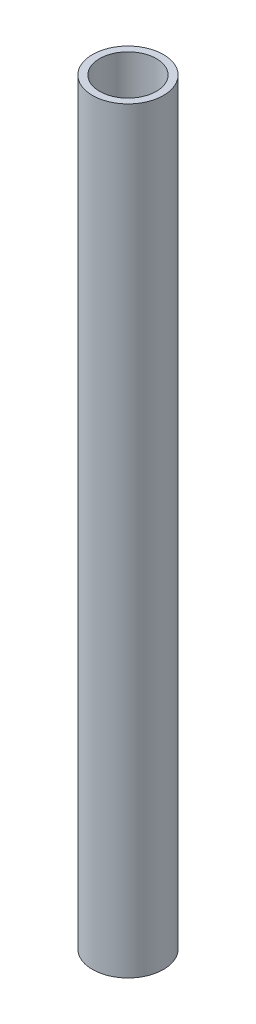
ISO-10303-21;
HEADER;
FILE_DESCRIPTION(('STEP AP214'),'2;1');
FILE_NAME('part.step','',(''),(''),'','','');
FILE_SCHEMA(('AUTOMOTIVE_DESIGN { 1 0 10303 214 1 1 1 1 }'));
ENDSEC;
DATA;
#1=APPLICATION_CONTEXT('core data for automotive mechanical design processes');
#2=APPLICATION_PROTOCOL_DEFINITION('international standard','automotive_design',2000,#1);
#3=PRODUCT_CONTEXT('',#1,'mechanical');
#4=PRODUCT('Part','Part','',(#3));
#5=PRODUCT_RELATED_PRODUCT_CATEGORY('part','',(#4));
#6=PRODUCT_DEFINITION_FORMATION('','',#4);
#7=PRODUCT_DEFINITION_CONTEXT('part definition',#1,'design');
#8=PRODUCT_DEFINITION('design','',#6,#7);
#9=PRODUCT_DEFINITION_SHAPE('','',#8);
#10=(LENGTH_UNIT() NAMED_UNIT(*) SI_UNIT(.MILLI.,.METRE.));
#11=(NAMED_UNIT(*) PLANE_ANGLE_UNIT() SI_UNIT($,.RADIAN.));
#12=(NAMED_UNIT(*) SI_UNIT($,.STERADIAN.) SOLID_ANGLE_UNIT());
#13=UNCERTAINTY_MEASURE_WITH_UNIT(LENGTH_MEASURE(1.E-05),#10,'distance_accuracy_value','');
#14=(GEOMETRIC_REPRESENTATION_CONTEXT(3) GLOBAL_UNCERTAINTY_ASSIGNED_CONTEXT((#13)) GLOBAL_UNIT_ASSIGNED_CONTEXT((#10,
#11,#12)) REPRESENTATION_CONTEXT('',''));
#15=CARTESIAN_POINT('',(0.,0.,0.));
#16=DIRECTION('',(0.,0.,1.));
#17=DIRECTION('',(1.,0.,0.));
#18=AXIS2_PLACEMENT_3D('',#15,#16,#17);
#19=CARTESIAN_POINT('',(0.,101.6,0.));
#20=DIRECTION('',(0.,1.,0.));
#21=DIRECTION('',(0.,0.,1.));
#22=AXIS2_PLACEMENT_3D('',#19,#20,#21);
#23=PLANE('',#22);
#24=CARTESIAN_POINT('',(0.,101.6,0.));
#25=DIRECTION('',(0.,1.,0.));
#26=DIRECTION('',(0.,0.,1.));
#27=AXIS2_PLACEMENT_3D('',#24,#25,#26);
#28=CIRCLE('',#27,4.7625);
#29=CARTESIAN_POINT('',(0.,101.6,4.7625));
#30=VERTEX_POINT('',#29);
#31=EDGE_CURVE('E10',#30,#30,#28,.T.);
#32=ORIENTED_EDGE('',*,*,#31,.T.);
#33=EDGE_LOOP('',(#32));
#34=FACE_BOUND('',#33,.T.);
#35=CARTESIAN_POINT('',(0.,101.6,0.));
#36=DIRECTION('',(0.,1.,0.));
#37=DIRECTION('',(0.,0.,1.));
#38=AXIS2_PLACEMENT_3D('',#35,#36,#37);
#39=CIRCLE('',#38,3.81);
#40=CARTESIAN_POINT('',(0.,101.6,3.81));
#41=VERTEX_POINT('',#40);
#42=EDGE_CURVE('E42',#41,#41,#39,.T.);
#43=ORIENTED_EDGE('',*,*,#42,.F.);
#44=EDGE_LOOP('',(#43));
#45=FACE_BOUND('',#44,.T.);
#46=ADVANCED_FACE('F31',(#34,#45),#23,.T.);
#47=CARTESIAN_POINT('',(0.,0.,0.));
#48=DIRECTION('',(0.,1.,0.));
#49=DIRECTION('',(0.,0.,1.));
#50=AXIS2_PLACEMENT_3D('',#47,#48,#49);
#51=PLANE('',#50);
#52=CARTESIAN_POINT('',(0.,0.,0.));
#53=DIRECTION('',(0.,1.,0.));
#54=DIRECTION('',(0.,0.,1.));
#55=AXIS2_PLACEMENT_3D('',#52,#53,#54);
#56=CIRCLE('',#55,4.7625);
#57=CARTESIAN_POINT('',(0.,0.,4.7625));
#58=VERTEX_POINT('',#57);
#59=EDGE_CURVE('E35',#58,#58,#56,.T.);
#60=ORIENTED_EDGE('',*,*,#59,.F.);
#61=EDGE_LOOP('',(#60));
#62=FACE_BOUND('',#61,.T.);
#63=CARTESIAN_POINT('',(0.,0.,0.));
#64=DIRECTION('',(0.,1.,0.));
#65=DIRECTION('',(0.,0.,1.));
#66=AXIS2_PLACEMENT_3D('',#63,#64,#65);
#67=CIRCLE('',#66,3.81);
#68=CARTESIAN_POINT('',(0.,0.,3.81));
#69=VERTEX_POINT('',#68);
#70=EDGE_CURVE('E44',#69,#69,#67,.T.);
#71=ORIENTED_EDGE('',*,*,#70,.T.);
#72=EDGE_LOOP('',(#71));
#73=FACE_BOUND('',#72,.T.);
#74=ADVANCED_FACE('F54',(#62,#73),#51,.F.);
#75=CARTESIAN_POINT('',(0.,101.6,0.));
#76=DIRECTION('',(0.,-1.,0.));
#77=DIRECTION('',(0.,0.,-1.));
#78=AXIS2_PLACEMENT_3D('',#75,#76,#77);
#79=CYLINDRICAL_SURFACE('',#78,4.7625);
#80=ORIENTED_EDGE('',*,*,#31,.F.);
#81=EDGE_LOOP('',(#80));
#82=FACE_BOUND('',#81,.T.);
#83=ORIENTED_EDGE('',*,*,#59,.T.);
#84=EDGE_LOOP('',(#83));
#85=FACE_BOUND('',#84,.T.);
#86=ADVANCED_FACE('F33',(#82,#85),#79,.T.);
#87=CARTESIAN_POINT('',(0.,101.6,0.));
#88=DIRECTION('',(0.,-1.,0.));
#89=DIRECTION('',(0.,0.,-1.));
#90=AXIS2_PLACEMENT_3D('',#87,#88,#89);
#91=CYLINDRICAL_SURFACE('',#90,3.81);
#92=ORIENTED_EDGE('',*,*,#42,.T.);
#93=EDGE_LOOP('',(#92));
#94=FACE_BOUND('',#93,.T.);
#95=ORIENTED_EDGE('',*,*,#70,.F.);
#96=EDGE_LOOP('',(#95));
#97=FACE_BOUND('',#96,.T.);
#98=ADVANCED_FACE('F50',(#94,#97),#91,.F.);
#99=CLOSED_SHELL('',(#46,#74,#86,#98));
#100=MANIFOLD_SOLID_BREP('B2',#99);
#101=ADVANCED_BREP_SHAPE_REPRESENTATION('',(#18,#100),#14);
#102=SHAPE_DEFINITION_REPRESENTATION(#9,#101);
ENDSEC;
END-ISO-10303-21;
